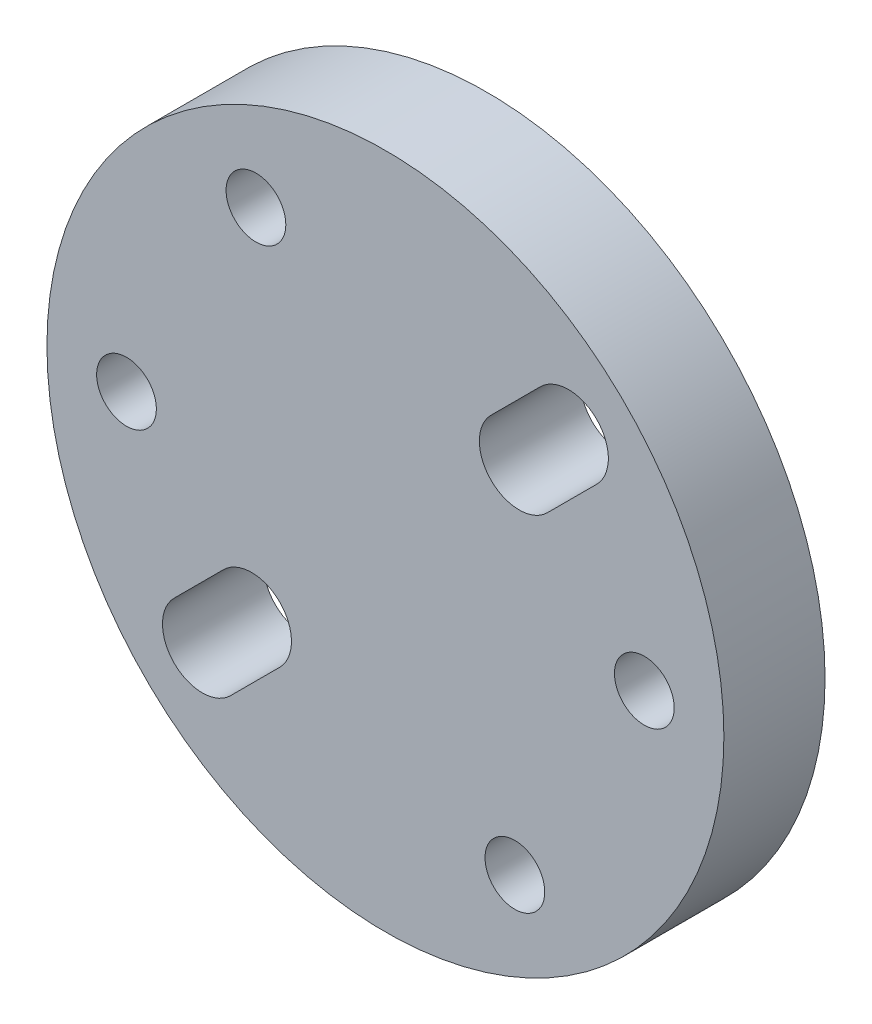
ISO-10303-21;
HEADER;
FILE_DESCRIPTION(('STEP AP214'),'2;1');
FILE_NAME('part.step','',(''),(''),'','','');
FILE_SCHEMA(('AUTOMOTIVE_DESIGN { 1 0 10303 214 1 1 1 1 }'));
ENDSEC;
DATA;
#1=APPLICATION_CONTEXT('core data for automotive mechanical design processes');
#2=APPLICATION_PROTOCOL_DEFINITION('international standard','automotive_design',2000,#1);
#3=PRODUCT_CONTEXT('',#1,'mechanical');
#4=PRODUCT('Part','Part','',(#3));
#5=PRODUCT_RELATED_PRODUCT_CATEGORY('part','',(#4));
#6=PRODUCT_DEFINITION_FORMATION('','',#4);
#7=PRODUCT_DEFINITION_CONTEXT('part definition',#1,'design');
#8=PRODUCT_DEFINITION('design','',#6,#7);
#9=PRODUCT_DEFINITION_SHAPE('','',#8);
#10=(LENGTH_UNIT() NAMED_UNIT(*) SI_UNIT(.MILLI.,.METRE.));
#11=(NAMED_UNIT(*) PLANE_ANGLE_UNIT() SI_UNIT($,.RADIAN.));
#12=(NAMED_UNIT(*) SI_UNIT($,.STERADIAN.) SOLID_ANGLE_UNIT());
#13=UNCERTAINTY_MEASURE_WITH_UNIT(LENGTH_MEASURE(1.E-05),#10,'distance_accuracy_value','');
#14=(GEOMETRIC_REPRESENTATION_CONTEXT(3) GLOBAL_UNCERTAINTY_ASSIGNED_CONTEXT((#13)) GLOBAL_UNIT_ASSIGNED_CONTEXT((#10,
#11,#12)) REPRESENTATION_CONTEXT('',''));
#15=CARTESIAN_POINT('',(0.,0.,0.));
#16=DIRECTION('',(0.,0.,1.));
#17=DIRECTION('',(1.,0.,0.));
#18=AXIS2_PLACEMENT_3D('',#15,#16,#17);
#19=CARTESIAN_POINT('',(-13.,0.,5.08));
#20=DIRECTION('',(0.,0.,-1.));
#21=DIRECTION('',(-1.,0.,0.));
#22=AXIS2_PLACEMENT_3D('',#19,#20,#21);
#23=CYLINDRICAL_SURFACE('',#22,1.5);
#24=CARTESIAN_POINT('',(-13.,0.,5.08));
#25=DIRECTION('',(0.,0.,1.));
#26=DIRECTION('',(1.,0.,0.));
#27=AXIS2_PLACEMENT_3D('',#24,#25,#26);
#28=CIRCLE('',#27,1.5);
#29=CARTESIAN_POINT('',(-11.5,0.,5.08));
#30=VERTEX_POINT('',#29);
#31=EDGE_CURVE('E202',#30,#30,#28,.T.);
#32=ORIENTED_EDGE('',*,*,#31,.T.);
#33=EDGE_LOOP('',(#32));
#34=FACE_BOUND('',#33,.T.);
#35=CARTESIAN_POINT('',(-13.,0.,0.));
#36=DIRECTION('',(0.,0.,1.));
#37=DIRECTION('',(1.,0.,0.));
#38=AXIS2_PLACEMENT_3D('',#35,#36,#37);
#39=CIRCLE('',#38,1.5);
#40=CARTESIAN_POINT('',(-11.5,0.,0.));
#41=VERTEX_POINT('',#40);
#42=EDGE_CURVE('E222',#41,#41,#39,.T.);
#43=ORIENTED_EDGE('',*,*,#42,.F.);
#44=EDGE_LOOP('',(#43));
#45=FACE_BOUND('',#44,.T.);
#46=ADVANCED_FACE('F43',(#34,#45),#23,.F.);
#47=CARTESIAN_POINT('',(-6.49999999999982,11.2583302491978,5.08));
#48=DIRECTION('',(0.,0.,-1.));
#49=DIRECTION('',(-1.,0.,0.));
#50=AXIS2_PLACEMENT_3D('',#47,#48,#49);
#51=CYLINDRICAL_SURFACE('',#50,1.5);
#52=CARTESIAN_POINT('',(-6.49999999999982,11.2583302491978,5.08));
#53=DIRECTION('',(0.,0.,1.));
#54=DIRECTION('',(1.,0.,0.));
#55=AXIS2_PLACEMENT_3D('',#52,#53,#54);
#56=CIRCLE('',#55,1.5);
#57=CARTESIAN_POINT('',(-4.99999999999982,11.2583302491978,5.08));
#58=VERTEX_POINT('',#57);
#59=EDGE_CURVE('E199',#58,#58,#56,.T.);
#60=ORIENTED_EDGE('',*,*,#59,.T.);
#61=EDGE_LOOP('',(#60));
#62=FACE_BOUND('',#61,.T.);
#63=CARTESIAN_POINT('',(-6.49999999999982,11.2583302491978,0.));
#64=DIRECTION('',(0.,0.,1.));
#65=DIRECTION('',(1.,0.,0.));
#66=AXIS2_PLACEMENT_3D('',#63,#64,#65);
#67=CIRCLE('',#66,1.5);
#68=CARTESIAN_POINT('',(-4.99999999999982,11.2583302491978,0.));
#69=VERTEX_POINT('',#68);
#70=EDGE_CURVE('E218',#69,#69,#67,.T.);
#71=ORIENTED_EDGE('',*,*,#70,.F.);
#72=EDGE_LOOP('',(#71));
#73=FACE_BOUND('',#72,.T.);
#74=ADVANCED_FACE('F269',(#62,#73),#51,.F.);
#75=CARTESIAN_POINT('',(13.,0.,5.08));
#76=DIRECTION('',(0.,0.,-1.));
#77=DIRECTION('',(-1.,0.,0.));
#78=AXIS2_PLACEMENT_3D('',#75,#76,#77);
#79=CYLINDRICAL_SURFACE('',#78,1.5);
#80=CARTESIAN_POINT('',(13.,0.,5.08));
#81=DIRECTION('',(0.,0.,1.));
#82=DIRECTION('',(1.,0.,0.));
#83=AXIS2_PLACEMENT_3D('',#80,#81,#82);
#84=CIRCLE('',#83,1.5);
#85=CARTESIAN_POINT('',(14.5,0.,5.08));
#86=VERTEX_POINT('',#85);
#87=EDGE_CURVE('E195',#86,#86,#84,.T.);
#88=ORIENTED_EDGE('',*,*,#87,.T.);
#89=EDGE_LOOP('',(#88));
#90=FACE_BOUND('',#89,.T.);
#91=CARTESIAN_POINT('',(13.,0.,0.));
#92=DIRECTION('',(0.,0.,1.));
#93=DIRECTION('',(1.,0.,0.));
#94=AXIS2_PLACEMENT_3D('',#91,#92,#93);
#95=CIRCLE('',#94,1.5);
#96=CARTESIAN_POINT('',(14.5,0.,0.));
#97=VERTEX_POINT('',#96);
#98=EDGE_CURVE('E214',#97,#97,#95,.T.);
#99=ORIENTED_EDGE('',*,*,#98,.F.);
#100=EDGE_LOOP('',(#99));
#101=FACE_BOUND('',#100,.T.);
#102=ADVANCED_FACE('F275',(#90,#101),#79,.F.);
#103=CARTESIAN_POINT('',(6.4999999999999,-11.2583302491978,5.08));
#104=DIRECTION('',(0.,0.,-1.));
#105=DIRECTION('',(-1.,0.,0.));
#106=AXIS2_PLACEMENT_3D('',#103,#104,#105);
#107=CYLINDRICAL_SURFACE('',#106,1.5);
#108=CARTESIAN_POINT('',(6.4999999999999,-11.2583302491978,5.08));
#109=DIRECTION('',(0.,0.,1.));
#110=DIRECTION('',(1.,0.,0.));
#111=AXIS2_PLACEMENT_3D('',#108,#109,#110);
#112=CIRCLE('',#111,1.5);
#113=CARTESIAN_POINT('',(7.9999999999999,-11.2583302491978,5.08));
#114=VERTEX_POINT('',#113);
#115=EDGE_CURVE('E191',#114,#114,#112,.T.);
#116=ORIENTED_EDGE('',*,*,#115,.T.);
#117=EDGE_LOOP('',(#116));
#118=FACE_BOUND('',#117,.T.);
#119=CARTESIAN_POINT('',(6.4999999999999,-11.2583302491978,0.));
#120=DIRECTION('',(0.,0.,1.));
#121=DIRECTION('',(1.,0.,0.));
#122=AXIS2_PLACEMENT_3D('',#119,#120,#121);
#123=CIRCLE('',#122,1.5);
#124=CARTESIAN_POINT('',(7.9999999999999,-11.2583302491978,0.));
#125=VERTEX_POINT('',#124);
#126=EDGE_CURVE('E160',#125,#125,#123,.T.);
#127=ORIENTED_EDGE('',*,*,#126,.F.);
#128=EDGE_LOOP('',(#127));
#129=FACE_BOUND('',#128,.T.);
#130=ADVANCED_FACE('F45',(#118,#129),#107,.F.);
#131=CARTESIAN_POINT('',(0.,0.,5.08));
#132=DIRECTION('',(0.,0.,-1.));
#133=DIRECTION('',(-1.,0.,0.));
#134=AXIS2_PLACEMENT_3D('',#131,#132,#133);
#135=CYLINDRICAL_SURFACE('',#134,16.995);
#136=CARTESIAN_POINT('',(0.,0.,5.08));
#137=DIRECTION('',(0.,0.,1.));
#138=DIRECTION('',(1.,0.,0.));
#139=AXIS2_PLACEMENT_3D('',#136,#137,#138);
#140=CIRCLE('',#139,16.995);
#141=CARTESIAN_POINT('',(16.995,0.,5.08));
#142=VERTEX_POINT('',#141);
#143=EDGE_CURVE('E206',#142,#142,#140,.T.);
#144=ORIENTED_EDGE('',*,*,#143,.F.);
#145=EDGE_LOOP('',(#144));
#146=FACE_BOUND('',#145,.T.);
#147=CARTESIAN_POINT('',(0.,0.,0.));
#148=DIRECTION('',(0.,0.,1.));
#149=DIRECTION('',(1.,0.,0.));
#150=AXIS2_PLACEMENT_3D('',#147,#148,#149);
#151=CIRCLE('',#150,16.995);
#152=CARTESIAN_POINT('',(16.995,0.,0.));
#153=VERTEX_POINT('',#152);
#154=EDGE_CURVE('E196',#153,#153,#151,.T.);
#155=ORIENTED_EDGE('',*,*,#154,.T.);
#156=EDGE_LOOP('',(#155));
#157=FACE_BOUND('',#156,.T.);
#158=ADVANCED_FACE('F280',(#146,#157),#135,.T.);
#159=CARTESIAN_POINT('',(0.,0.,5.08));
#160=DIRECTION('',(0.,0.,1.));
#161=DIRECTION('',(1.,0.,0.));
#162=AXIS2_PLACEMENT_3D('',#159,#160,#161);
#163=PLANE('',#162);
#164=CARTESIAN_POINT('',(-6.71751442127215,-6.71751442127218,5.08));
#165=DIRECTION('',(0.,0.,1.));
#166=DIRECTION('',(1.,0.,0.));
#167=AXIS2_PLACEMENT_3D('',#164,#165,#166);
#168=CIRCLE('',#167,1.99999999999994);
#169=CARTESIAN_POINT('',(-5.30330085889909,-8.13172798364523,5.08));
#170=VERTEX_POINT('',#169);
#171=CARTESIAN_POINT('',(-8.13172798364521,-5.30330085889913,5.08));
#172=VERTEX_POINT('',#171);
#173=EDGE_CURVE('E62',#170,#172,#168,.T.);
#174=ORIENTED_EDGE('',*,*,#173,.F.);
#175=DIRECTION('',(0.707106781186546,0.707106781186549,0.));
#176=VECTOR('',#175,1.);
#177=CARTESIAN_POINT('',(1.41421356237306,-1.41421356237305,5.08));
#178=LINE('',#177,#176);
#179=CARTESIAN_POINT('',(-7.77817459305213,-10.6066017177983,5.08));
#180=VERTEX_POINT('',#179);
#181=EDGE_CURVE('E149',#180,#170,#178,.T.);
#182=ORIENTED_EDGE('',*,*,#181,.F.);
#183=CARTESIAN_POINT('',(-9.19238815542519,-9.19238815542524,5.08));
#184=DIRECTION('',(0.,0.,1.));
#185=DIRECTION('',(1.,0.,0.));
#186=AXIS2_PLACEMENT_3D('',#183,#184,#185);
#187=CIRCLE('',#186,1.99999999999994);
#188=CARTESIAN_POINT('',(-10.6066017177983,-7.77817459305218,5.08));
#189=VERTEX_POINT('',#188);
#190=EDGE_CURVE('E130',#189,#180,#187,.T.);
#191=ORIENTED_EDGE('',*,*,#190,.F.);
#192=DIRECTION('',(0.707106781186546,0.707106781186549,0.));
#193=VECTOR('',#192,1.);
#194=CARTESIAN_POINT('',(-1.41421356237306,1.41421356237305,5.08));
#195=LINE('',#194,#193);
#196=EDGE_CURVE('E141',#189,#172,#195,.T.);
#197=ORIENTED_EDGE('',*,*,#196,.T.);
#198=EDGE_LOOP('',(#174,#182,#191,#197));
#199=FACE_BOUND('',#198,.T.);
#200=CARTESIAN_POINT('',(9.1923881554252,9.19238815542524,5.08));
#201=DIRECTION('',(0.,0.,1.));
#202=DIRECTION('',(1.,0.,0.));
#203=AXIS2_PLACEMENT_3D('',#200,#201,#202);
#204=CIRCLE('',#203,1.99999999999992);
#205=CARTESIAN_POINT('',(10.6066017177983,7.77817459305232,5.08));
#206=VERTEX_POINT('',#205);
#207=CARTESIAN_POINT('',(7.77817459305214,10.6066017177983,5.08));
#208=VERTEX_POINT('',#207);
#209=EDGE_CURVE('E73',#206,#208,#204,.T.);
#210=ORIENTED_EDGE('',*,*,#209,.F.);
#211=DIRECTION('',(0.707106781186546,0.707106781186549,0.));
#212=VECTOR('',#211,1.);
#213=CARTESIAN_POINT('',(1.41421356237303,-1.41421356237303,5.08));
#214=LINE('',#213,#212);
#215=CARTESIAN_POINT('',(8.13172798364529,5.30330085889927,5.08));
#216=VERTEX_POINT('',#215);
#217=EDGE_CURVE('E175',#216,#206,#214,.T.);
#218=ORIENTED_EDGE('',*,*,#217,.F.);
#219=CARTESIAN_POINT('',(6.71751442127215,6.71751442127218,5.08));
#220=DIRECTION('',(0.,0.,1.));
#221=DIRECTION('',(1.,0.,0.));
#222=AXIS2_PLACEMENT_3D('',#219,#220,#221);
#223=CIRCLE('',#222,1.99999999999992);
#224=CARTESIAN_POINT('',(5.30330085889909,8.13172798364523,5.08));
#225=VERTEX_POINT('',#224);
#226=EDGE_CURVE('E171',#225,#216,#223,.T.);
#227=ORIENTED_EDGE('',*,*,#226,.F.);
#228=DIRECTION('',(0.707106781186546,0.707106781186549,0.));
#229=VECTOR('',#228,1.);
#230=CARTESIAN_POINT('',(-1.41421356237306,1.41421356237305,5.08));
#231=LINE('',#230,#229);
#232=EDGE_CURVE('E167',#225,#208,#231,.T.);
#233=ORIENTED_EDGE('',*,*,#232,.T.);
#234=EDGE_LOOP('',(#210,#218,#227,#233));
#235=FACE_BOUND('',#234,.T.);
#236=ORIENTED_EDGE('',*,*,#115,.F.);
#237=EDGE_LOOP('',(#236));
#238=FACE_BOUND('',#237,.T.);
#239=ORIENTED_EDGE('',*,*,#87,.F.);
#240=EDGE_LOOP('',(#239));
#241=FACE_BOUND('',#240,.T.);
#242=ORIENTED_EDGE('',*,*,#59,.F.);
#243=EDGE_LOOP('',(#242));
#244=FACE_BOUND('',#243,.T.);
#245=ORIENTED_EDGE('',*,*,#31,.F.);
#246=EDGE_LOOP('',(#245));
#247=FACE_BOUND('',#246,.T.);
#248=ORIENTED_EDGE('',*,*,#143,.T.);
#249=EDGE_LOOP('',(#248));
#250=FACE_BOUND('',#249,.T.);
#251=ADVANCED_FACE('F146',(#199,#235,#238,#241,#244,#247,#250),#163,.T.);
#252=CARTESIAN_POINT('',(0.,0.,0.));
#253=DIRECTION('',(0.,0.,1.));
#254=DIRECTION('',(1.,0.,0.));
#255=AXIS2_PLACEMENT_3D('',#252,#253,#254);
#256=PLANE('',#255);
#257=DIRECTION('',(0.707106781186546,0.707106781186549,0.));
#258=VECTOR('',#257,1.);
#259=CARTESIAN_POINT('',(1.41421356237306,-1.41421356237305,0.));
#260=LINE('',#259,#258);
#261=CARTESIAN_POINT('',(-7.77817459305213,-10.6066017177983,0.));
#262=VERTEX_POINT('',#261);
#263=CARTESIAN_POINT('',(-5.30330085889909,-8.13172798364523,0.));
#264=VERTEX_POINT('',#263);
#265=EDGE_CURVE('E52',#262,#264,#260,.T.);
#266=ORIENTED_EDGE('',*,*,#265,.T.);
#267=CARTESIAN_POINT('',(-6.71751442127215,-6.71751442127218,0.));
#268=DIRECTION('',(0.,0.,1.));
#269=DIRECTION('',(1.,0.,0.));
#270=AXIS2_PLACEMENT_3D('',#267,#268,#269);
#271=CIRCLE('',#270,1.99999999999994);
#272=CARTESIAN_POINT('',(-8.13172798364521,-5.30330085889913,0.));
#273=VERTEX_POINT('',#272);
#274=EDGE_CURVE('E11',#264,#273,#271,.T.);
#275=ORIENTED_EDGE('',*,*,#274,.T.);
#276=DIRECTION('',(0.707106781186546,0.707106781186549,0.));
#277=VECTOR('',#276,1.);
#278=CARTESIAN_POINT('',(-1.41421356237306,1.41421356237305,0.));
#279=LINE('',#278,#277);
#280=CARTESIAN_POINT('',(-10.6066017177983,-7.77817459305218,0.));
#281=VERTEX_POINT('',#280);
#282=EDGE_CURVE('E243',#281,#273,#279,.T.);
#283=ORIENTED_EDGE('',*,*,#282,.F.);
#284=CARTESIAN_POINT('',(-9.19238815542519,-9.19238815542524,0.));
#285=DIRECTION('',(0.,0.,1.));
#286=DIRECTION('',(1.,0.,0.));
#287=AXIS2_PLACEMENT_3D('',#284,#285,#286);
#288=CIRCLE('',#287,1.99999999999994);
#289=EDGE_CURVE('E133',#281,#262,#288,.T.);
#290=ORIENTED_EDGE('',*,*,#289,.T.);
#291=EDGE_LOOP('',(#266,#275,#283,#290));
#292=FACE_BOUND('',#291,.T.);
#293=DIRECTION('',(0.707106781186546,0.707106781186549,0.));
#294=VECTOR('',#293,1.);
#295=CARTESIAN_POINT('',(1.41421356237303,-1.41421356237303,0.));
#296=LINE('',#295,#294);
#297=CARTESIAN_POINT('',(8.13172798364529,5.30330085889927,0.));
#298=VERTEX_POINT('',#297);
#299=CARTESIAN_POINT('',(10.6066017177983,7.77817459305232,0.));
#300=VERTEX_POINT('',#299);
#301=EDGE_CURVE('E235',#298,#300,#296,.T.);
#302=ORIENTED_EDGE('',*,*,#301,.T.);
#303=CARTESIAN_POINT('',(9.1923881554252,9.19238815542524,0.));
#304=DIRECTION('',(0.,0.,1.));
#305=DIRECTION('',(1.,0.,0.));
#306=AXIS2_PLACEMENT_3D('',#303,#304,#305);
#307=CIRCLE('',#306,1.99999999999992);
#308=CARTESIAN_POINT('',(7.77817459305214,10.6066017177983,0.));
#309=VERTEX_POINT('',#308);
#310=EDGE_CURVE('E239',#300,#309,#307,.T.);
#311=ORIENTED_EDGE('',*,*,#310,.T.);
#312=DIRECTION('',(0.707106781186546,0.707106781186549,0.));
#313=VECTOR('',#312,1.);
#314=CARTESIAN_POINT('',(-1.41421356237306,1.41421356237305,0.));
#315=LINE('',#314,#313);
#316=CARTESIAN_POINT('',(5.30330085889909,8.13172798364523,0.));
#317=VERTEX_POINT('',#316);
#318=EDGE_CURVE('E210',#317,#309,#315,.T.);
#319=ORIENTED_EDGE('',*,*,#318,.F.);
#320=CARTESIAN_POINT('',(6.71751442127215,6.71751442127218,0.));
#321=DIRECTION('',(0.,0.,1.));
#322=DIRECTION('',(1.,0.,0.));
#323=AXIS2_PLACEMENT_3D('',#320,#321,#322);
#324=CIRCLE('',#323,1.99999999999992);
#325=EDGE_CURVE('E231',#317,#298,#324,.T.);
#326=ORIENTED_EDGE('',*,*,#325,.T.);
#327=EDGE_LOOP('',(#302,#311,#319,#326));
#328=FACE_BOUND('',#327,.T.);
#329=ORIENTED_EDGE('',*,*,#126,.T.);
#330=EDGE_LOOP('',(#329));
#331=FACE_BOUND('',#330,.T.);
#332=ORIENTED_EDGE('',*,*,#98,.T.);
#333=EDGE_LOOP('',(#332));
#334=FACE_BOUND('',#333,.T.);
#335=ORIENTED_EDGE('',*,*,#70,.T.);
#336=EDGE_LOOP('',(#335));
#337=FACE_BOUND('',#336,.T.);
#338=ORIENTED_EDGE('',*,*,#42,.T.);
#339=EDGE_LOOP('',(#338));
#340=FACE_BOUND('',#339,.T.);
#341=ORIENTED_EDGE('',*,*,#154,.F.);
#342=EDGE_LOOP('',(#341));
#343=FACE_BOUND('',#342,.T.);
#344=ADVANCED_FACE('F249',(#292,#328,#331,#334,#337,#340,#343),#256,.F.);
#345=CARTESIAN_POINT('',(9.1923881554252,9.19238815542524,-4.92));
#346=DIRECTION('',(0.,0.,1.));
#347=DIRECTION('',(1.,0.,0.));
#348=AXIS2_PLACEMENT_3D('',#345,#346,#347);
#349=CYLINDRICAL_SURFACE('',#348,1.99999999999992);
#350=DIRECTION('',(0.,0.,1.));
#351=VECTOR('',#350,1.);
#352=CARTESIAN_POINT('',(10.6066017177983,7.77817459305232,-4.92));
#353=LINE('',#352,#351);
#354=EDGE_CURVE('E180',#300,#206,#353,.T.);
#355=ORIENTED_EDGE('',*,*,#354,.T.);
#356=ORIENTED_EDGE('',*,*,#209,.T.);
#357=DIRECTION('',(0.,0.,1.));
#358=VECTOR('',#357,1.);
#359=CARTESIAN_POINT('',(7.77817459305214,10.6066017177983,-4.92));
#360=LINE('',#359,#358);
#361=EDGE_CURVE('E179',#309,#208,#360,.T.);
#362=ORIENTED_EDGE('',*,*,#361,.F.);
#363=ORIENTED_EDGE('',*,*,#310,.F.);
#364=EDGE_LOOP('',(#355,#356,#362,#363));
#365=FACE_BOUND('',#364,.T.);
#366=ADVANCED_FACE('F294',(#365),#349,.F.);
#367=CARTESIAN_POINT('',(1.41421356237303,-1.41421356237303,-4.92));
#368=DIRECTION('',(0.707106781186549,-0.707106781186546,0.));
#369=DIRECTION('',(0.707106781186546,0.707106781186549,0.));
#370=AXIS2_PLACEMENT_3D('',#367,#368,#369);
#371=PLANE('',#370);
#372=DIRECTION('',(0.,0.,1.));
#373=VECTOR('',#372,1.);
#374=CARTESIAN_POINT('',(8.13172798364529,5.30330085889927,-4.92));
#375=LINE('',#374,#373);
#376=EDGE_CURVE('E183',#298,#216,#375,.T.);
#377=ORIENTED_EDGE('',*,*,#376,.T.);
#378=ORIENTED_EDGE('',*,*,#217,.T.);
#379=ORIENTED_EDGE('',*,*,#354,.F.);
#380=ORIENTED_EDGE('',*,*,#301,.F.);
#381=EDGE_LOOP('',(#377,#378,#379,#380));
#382=FACE_BOUND('',#381,.T.);
#383=ADVANCED_FACE('F313',(#382),#371,.F.);
#384=CARTESIAN_POINT('',(6.71751442127215,6.71751442127218,-4.92));
#385=DIRECTION('',(0.,0.,1.));
#386=DIRECTION('',(1.,0.,0.));
#387=AXIS2_PLACEMENT_3D('',#384,#385,#386);
#388=CYLINDRICAL_SURFACE('',#387,1.99999999999992);
#389=DIRECTION('',(0.,0.,1.));
#390=VECTOR('',#389,1.);
#391=CARTESIAN_POINT('',(5.30330085889909,8.13172798364523,-4.92));
#392=LINE('',#391,#390);
#393=EDGE_CURVE('E186',#317,#225,#392,.T.);
#394=ORIENTED_EDGE('',*,*,#393,.T.);
#395=ORIENTED_EDGE('',*,*,#226,.T.);
#396=ORIENTED_EDGE('',*,*,#376,.F.);
#397=ORIENTED_EDGE('',*,*,#325,.F.);
#398=EDGE_LOOP('',(#394,#395,#396,#397));
#399=FACE_BOUND('',#398,.T.);
#400=ADVANCED_FACE('F263',(#399),#388,.F.);
#401=CARTESIAN_POINT('',(-1.41421356237306,1.41421356237305,-4.92));
#402=DIRECTION('',(0.707106781186549,-0.707106781186546,0.));
#403=DIRECTION('',(0.707106781186546,0.707106781186549,0.));
#404=AXIS2_PLACEMENT_3D('',#401,#402,#403);
#405=PLANE('',#404);
#406=ORIENTED_EDGE('',*,*,#318,.T.);
#407=ORIENTED_EDGE('',*,*,#361,.T.);
#408=ORIENTED_EDGE('',*,*,#232,.F.);
#409=ORIENTED_EDGE('',*,*,#393,.F.);
#410=EDGE_LOOP('',(#406,#407,#408,#409));
#411=FACE_BOUND('',#410,.T.);
#412=ADVANCED_FACE('F256',(#411),#405,.T.);
#413=CARTESIAN_POINT('',(-6.71751442127215,-6.71751442127218,-4.92));
#414=DIRECTION('',(0.,0.,1.));
#415=DIRECTION('',(1.,0.,0.));
#416=AXIS2_PLACEMENT_3D('',#413,#414,#415);
#417=CYLINDRICAL_SURFACE('',#416,1.99999999999994);
#418=DIRECTION('',(0.,0.,1.));
#419=VECTOR('',#418,1.);
#420=CARTESIAN_POINT('',(-5.30330085889909,-8.13172798364523,-4.92));
#421=LINE('',#420,#419);
#422=EDGE_CURVE('E157',#264,#170,#421,.T.);
#423=ORIENTED_EDGE('',*,*,#422,.T.);
#424=ORIENTED_EDGE('',*,*,#173,.T.);
#425=DIRECTION('',(0.,0.,1.));
#426=VECTOR('',#425,1.);
#427=CARTESIAN_POINT('',(-8.13172798364521,-5.30330085889913,-4.92));
#428=LINE('',#427,#426);
#429=EDGE_CURVE('E138',#273,#172,#428,.T.);
#430=ORIENTED_EDGE('',*,*,#429,.F.);
#431=ORIENTED_EDGE('',*,*,#274,.F.);
#432=EDGE_LOOP('',(#423,#424,#430,#431));
#433=FACE_BOUND('',#432,.T.);
#434=ADVANCED_FACE('F254',(#433),#417,.F.);
#435=CARTESIAN_POINT('',(1.41421356237306,-1.41421356237305,-4.92));
#436=DIRECTION('',(0.707106781186549,-0.707106781186546,0.));
#437=DIRECTION('',(0.707106781186546,0.707106781186549,0.));
#438=AXIS2_PLACEMENT_3D('',#435,#436,#437);
#439=PLANE('',#438);
#440=DIRECTION('',(0.,0.,1.));
#441=VECTOR('',#440,1.);
#442=CARTESIAN_POINT('',(-7.77817459305213,-10.6066017177983,-4.92));
#443=LINE('',#442,#441);
#444=EDGE_CURVE('E137',#262,#180,#443,.T.);
#445=ORIENTED_EDGE('',*,*,#444,.T.);
#446=ORIENTED_EDGE('',*,*,#181,.T.);
#447=ORIENTED_EDGE('',*,*,#422,.F.);
#448=ORIENTED_EDGE('',*,*,#265,.F.);
#449=EDGE_LOOP('',(#445,#446,#447,#448));
#450=FACE_BOUND('',#449,.T.);
#451=ADVANCED_FACE('F253',(#450),#439,.F.);
#452=CARTESIAN_POINT('',(-9.19238815542519,-9.19238815542524,-4.92));
#453=DIRECTION('',(0.,0.,1.));
#454=DIRECTION('',(1.,0.,0.));
#455=AXIS2_PLACEMENT_3D('',#452,#453,#454);
#456=CYLINDRICAL_SURFACE('',#455,1.99999999999994);
#457=DIRECTION('',(0.,0.,1.));
#458=VECTOR('',#457,1.);
#459=CARTESIAN_POINT('',(-10.6066017177983,-7.77817459305218,-4.92));
#460=LINE('',#459,#458);
#461=EDGE_CURVE('E125',#281,#189,#460,.T.);
#462=ORIENTED_EDGE('',*,*,#461,.T.);
#463=ORIENTED_EDGE('',*,*,#190,.T.);
#464=ORIENTED_EDGE('',*,*,#444,.F.);
#465=ORIENTED_EDGE('',*,*,#289,.F.);
#466=EDGE_LOOP('',(#462,#463,#464,#465));
#467=FACE_BOUND('',#466,.T.);
#468=ADVANCED_FACE('F127',(#467),#456,.F.);
#469=CARTESIAN_POINT('',(-1.41421356237306,1.41421356237305,-4.92));
#470=DIRECTION('',(0.707106781186549,-0.707106781186546,0.));
#471=DIRECTION('',(0.707106781186546,0.707106781186549,0.));
#472=AXIS2_PLACEMENT_3D('',#469,#470,#471);
#473=PLANE('',#472);
#474=ORIENTED_EDGE('',*,*,#282,.T.);
#475=ORIENTED_EDGE('',*,*,#429,.T.);
#476=ORIENTED_EDGE('',*,*,#196,.F.);
#477=ORIENTED_EDGE('',*,*,#461,.F.);
#478=EDGE_LOOP('',(#474,#475,#476,#477));
#479=FACE_BOUND('',#478,.T.);
#480=ADVANCED_FACE('F142',(#479),#473,.T.);
#481=CLOSED_SHELL('',(#46,#74,#102,#130,#158,#251,#344,#366,#383,#400,#412,#434,#451,#468,#480));
#482=MANIFOLD_SOLID_BREP('B2',#481);
#483=ADVANCED_BREP_SHAPE_REPRESENTATION('',(#18,#482),#14);
#484=SHAPE_DEFINITION_REPRESENTATION(#9,#483);
ENDSEC;
END-ISO-10303-21;
